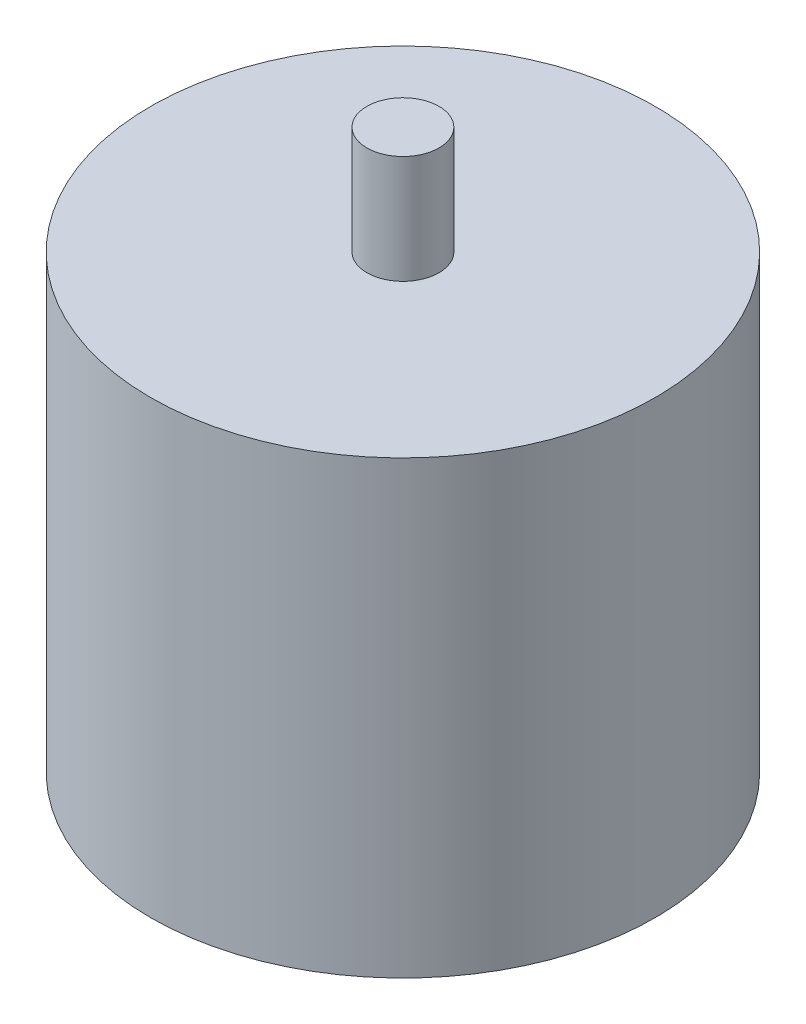
ISO-10303-21;
HEADER;
FILE_DESCRIPTION(('STEP AP214'),'2;1');
FILE_NAME('part.step','',(''),(''),'','','');
FILE_SCHEMA(('AUTOMOTIVE_DESIGN { 1 0 10303 214 1 1 1 1 }'));
ENDSEC;
DATA;
#1=APPLICATION_CONTEXT('core data for automotive mechanical design processes');
#2=APPLICATION_PROTOCOL_DEFINITION('international standard','automotive_design',2000,#1);
#3=PRODUCT_CONTEXT('',#1,'mechanical');
#4=PRODUCT('Part','Part','',(#3));
#5=PRODUCT_RELATED_PRODUCT_CATEGORY('part','',(#4));
#6=PRODUCT_DEFINITION_FORMATION('','',#4);
#7=PRODUCT_DEFINITION_CONTEXT('part definition',#1,'design');
#8=PRODUCT_DEFINITION('design','',#6,#7);
#9=PRODUCT_DEFINITION_SHAPE('','',#8);
#10=(LENGTH_UNIT() NAMED_UNIT(*) SI_UNIT(.MILLI.,.METRE.));
#11=(NAMED_UNIT(*) PLANE_ANGLE_UNIT() SI_UNIT($,.RADIAN.));
#12=(NAMED_UNIT(*) SI_UNIT($,.STERADIAN.) SOLID_ANGLE_UNIT());
#13=UNCERTAINTY_MEASURE_WITH_UNIT(LENGTH_MEASURE(1.E-05),#10,'distance_accuracy_value','');
#14=(GEOMETRIC_REPRESENTATION_CONTEXT(3) GLOBAL_UNCERTAINTY_ASSIGNED_CONTEXT((#13)) GLOBAL_UNIT_ASSIGNED_CONTEXT((#10,
#11,#12)) REPRESENTATION_CONTEXT('',''));
#15=CARTESIAN_POINT('',(0.,0.,0.));
#16=DIRECTION('',(0.,0.,1.));
#17=DIRECTION('',(1.,0.,0.));
#18=AXIS2_PLACEMENT_3D('',#15,#16,#17);
#19=CARTESIAN_POINT('',(0.,25.,0.));
#20=DIRECTION('',(0.,-1.,0.));
#21=DIRECTION('',(0.,0.,-1.));
#22=AXIS2_PLACEMENT_3D('',#19,#20,#21);
#23=CYLINDRICAL_SURFACE('',#22,14.);
#24=CARTESIAN_POINT('',(0.,25.,0.));
#25=DIRECTION('',(0.,1.,0.));
#26=DIRECTION('',(0.,0.,1.));
#27=AXIS2_PLACEMENT_3D('',#24,#25,#26);
#28=CIRCLE('',#27,14.);
#29=CARTESIAN_POINT('',(0.,25.,14.));
#30=VERTEX_POINT('',#29);
#31=EDGE_CURVE('E10',#30,#30,#28,.T.);
#32=ORIENTED_EDGE('',*,*,#31,.F.);
#33=EDGE_LOOP('',(#32));
#34=FACE_BOUND('',#33,.T.);
#35=CARTESIAN_POINT('',(0.,0.,0.));
#36=DIRECTION('',(0.,1.,0.));
#37=DIRECTION('',(0.,0.,1.));
#38=AXIS2_PLACEMENT_3D('',#35,#36,#37);
#39=CIRCLE('',#38,14.);
#40=CARTESIAN_POINT('',(0.,0.,14.));
#41=VERTEX_POINT('',#40);
#42=EDGE_CURVE('E33',#41,#41,#39,.T.);
#43=ORIENTED_EDGE('',*,*,#42,.T.);
#44=EDGE_LOOP('',(#43));
#45=FACE_BOUND('',#44,.T.);
#46=ADVANCED_FACE('F30',(#34,#45),#23,.T.);
#47=CARTESIAN_POINT('',(0.,25.,0.));
#48=DIRECTION('',(0.,1.,0.));
#49=DIRECTION('',(0.,0.,1.));
#50=AXIS2_PLACEMENT_3D('',#47,#48,#49);
#51=PLANE('',#50);
#52=CARTESIAN_POINT('',(0.,25.,0.));
#53=DIRECTION('',(0.,1.,0.));
#54=DIRECTION('',(0.,0.,1.));
#55=AXIS2_PLACEMENT_3D('',#52,#53,#54);
#56=CIRCLE('',#55,2.);
#57=CARTESIAN_POINT('',(0.,25.,2.));
#58=VERTEX_POINT('',#57);
#59=EDGE_CURVE('E42',#58,#58,#56,.T.);
#60=ORIENTED_EDGE('',*,*,#59,.F.);
#61=EDGE_LOOP('',(#60));
#62=FACE_BOUND('',#61,.T.);
#63=ORIENTED_EDGE('',*,*,#31,.T.);
#64=EDGE_LOOP('',(#63));
#65=FACE_BOUND('',#64,.T.);
#66=ADVANCED_FACE('F57',(#62,#65),#51,.T.);
#67=CARTESIAN_POINT('',(0.,0.,0.));
#68=DIRECTION('',(0.,1.,0.));
#69=DIRECTION('',(0.,0.,1.));
#70=AXIS2_PLACEMENT_3D('',#67,#68,#69);
#71=PLANE('',#70);
#72=ORIENTED_EDGE('',*,*,#42,.F.);
#73=EDGE_LOOP('',(#72));
#74=FACE_BOUND('',#73,.T.);
#75=ADVANCED_FACE('F53',(#74),#71,.F.);
#76=CARTESIAN_POINT('',(0.,31.,0.));
#77=DIRECTION('',(0.,-1.,0.));
#78=DIRECTION('',(0.,0.,-1.));
#79=AXIS2_PLACEMENT_3D('',#76,#77,#78);
#80=CYLINDRICAL_SURFACE('',#79,2.);
#81=CARTESIAN_POINT('',(0.,31.,0.));
#82=DIRECTION('',(0.,1.,0.));
#83=DIRECTION('',(0.,0.,1.));
#84=AXIS2_PLACEMENT_3D('',#81,#82,#83);
#85=CIRCLE('',#84,2.);
#86=CARTESIAN_POINT('',(0.,31.,2.));
#87=VERTEX_POINT('',#86);
#88=EDGE_CURVE('E40',#87,#87,#85,.T.);
#89=ORIENTED_EDGE('',*,*,#88,.F.);
#90=EDGE_LOOP('',(#89));
#91=FACE_BOUND('',#90,.T.);
#92=ORIENTED_EDGE('',*,*,#59,.T.);
#93=EDGE_LOOP('',(#92));
#94=FACE_BOUND('',#93,.T.);
#95=ADVANCED_FACE('F50',(#91,#94),#80,.T.);
#96=CARTESIAN_POINT('',(0.,31.,0.));
#97=DIRECTION('',(0.,1.,0.));
#98=DIRECTION('',(0.,0.,1.));
#99=AXIS2_PLACEMENT_3D('',#96,#97,#98);
#100=PLANE('',#99);
#101=ORIENTED_EDGE('',*,*,#88,.T.);
#102=EDGE_LOOP('',(#101));
#103=FACE_BOUND('',#102,.T.);
#104=ADVANCED_FACE('F48',(#103),#100,.T.);
#105=CLOSED_SHELL('',(#46,#66,#75,#95,#104));
#106=MANIFOLD_SOLID_BREP('B2',#105);
#107=ADVANCED_BREP_SHAPE_REPRESENTATION('',(#18,#106),#14);
#108=SHAPE_DEFINITION_REPRESENTATION(#9,#107);
ENDSEC;
END-ISO-10303-21;
